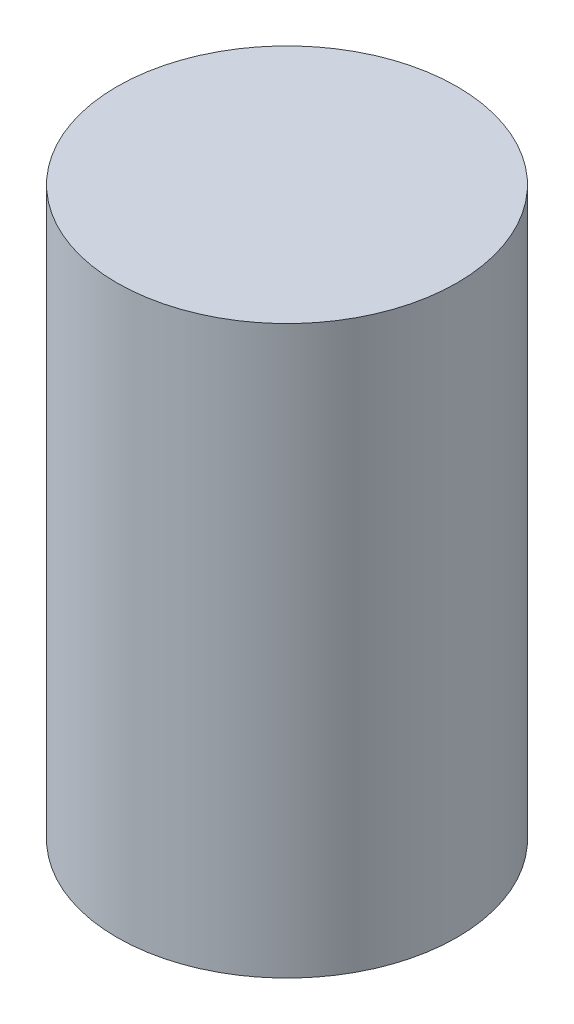
ISO-10303-21;
HEADER;
FILE_DESCRIPTION(('STEP AP214'),'2;1');
FILE_NAME('part.step','',(''),(''),'','','');
FILE_SCHEMA(('AUTOMOTIVE_DESIGN { 1 0 10303 214 1 1 1 1 }'));
ENDSEC;
DATA;
#1=APPLICATION_CONTEXT('core data for automotive mechanical design processes');
#2=APPLICATION_PROTOCOL_DEFINITION('international standard','automotive_design',2000,#1);
#3=PRODUCT_CONTEXT('',#1,'mechanical');
#4=PRODUCT('Part','Part','',(#3));
#5=PRODUCT_RELATED_PRODUCT_CATEGORY('part','',(#4));
#6=PRODUCT_DEFINITION_FORMATION('','',#4);
#7=PRODUCT_DEFINITION_CONTEXT('part definition',#1,'design');
#8=PRODUCT_DEFINITION('design','',#6,#7);
#9=PRODUCT_DEFINITION_SHAPE('','',#8);
#10=(LENGTH_UNIT() NAMED_UNIT(*) SI_UNIT(.MILLI.,.METRE.));
#11=(NAMED_UNIT(*) PLANE_ANGLE_UNIT() SI_UNIT($,.RADIAN.));
#12=(NAMED_UNIT(*) SI_UNIT($,.STERADIAN.) SOLID_ANGLE_UNIT());
#13=UNCERTAINTY_MEASURE_WITH_UNIT(LENGTH_MEASURE(1.E-05),#10,'distance_accuracy_value','');
#14=(GEOMETRIC_REPRESENTATION_CONTEXT(3) GLOBAL_UNCERTAINTY_ASSIGNED_CONTEXT((#13)) GLOBAL_UNIT_ASSIGNED_CONTEXT((#10,
#11,#12)) REPRESENTATION_CONTEXT('',''));
#15=CARTESIAN_POINT('',(0.,0.,0.));
#16=DIRECTION('',(0.,0.,1.));
#17=DIRECTION('',(1.,0.,0.));
#18=AXIS2_PLACEMENT_3D('',#15,#16,#17);
#19=CARTESIAN_POINT('',(0.,2.5,0.));
#20=DIRECTION('',(0.,-1.,0.));
#21=DIRECTION('',(0.,0.,-1.));
#22=AXIS2_PLACEMENT_3D('',#19,#20,#21);
#23=CYLINDRICAL_SURFACE('',#22,1.5);
#24=CARTESIAN_POINT('',(0.,2.5,0.));
#25=DIRECTION('',(0.,1.,0.));
#26=DIRECTION('',(0.,0.,1.));
#27=AXIS2_PLACEMENT_3D('',#24,#25,#26);
#28=CIRCLE('',#27,1.5);
#29=CARTESIAN_POINT('',(0.,2.5,1.5));
#30=VERTEX_POINT('',#29);
#31=EDGE_CURVE('E10',#30,#30,#28,.T.);
#32=ORIENTED_EDGE('',*,*,#31,.F.);
#33=EDGE_LOOP('',(#32));
#34=FACE_BOUND('',#33,.T.);
#35=CARTESIAN_POINT('',(0.,-2.5,0.));
#36=DIRECTION('',(0.,1.,0.));
#37=DIRECTION('',(0.,0.,1.));
#38=AXIS2_PLACEMENT_3D('',#35,#36,#37);
#39=CIRCLE('',#38,1.5);
#40=CARTESIAN_POINT('',(0.,-2.5,1.5));
#41=VERTEX_POINT('',#40);
#42=EDGE_CURVE('E37',#41,#41,#39,.T.);
#43=ORIENTED_EDGE('',*,*,#42,.T.);
#44=EDGE_LOOP('',(#43));
#45=FACE_BOUND('',#44,.T.);
#46=ADVANCED_FACE('F34',(#34,#45),#23,.T.);
#47=CARTESIAN_POINT('',(0.,2.5,0.));
#48=DIRECTION('',(0.,1.,0.));
#49=DIRECTION('',(0.,0.,1.));
#50=AXIS2_PLACEMENT_3D('',#47,#48,#49);
#51=PLANE('',#50);
#52=ORIENTED_EDGE('',*,*,#31,.T.);
#53=EDGE_LOOP('',(#52));
#54=FACE_BOUND('',#53,.T.);
#55=ADVANCED_FACE('F49',(#54),#51,.T.);
#56=CARTESIAN_POINT('',(0.,-2.5,0.));
#57=DIRECTION('',(0.,1.,0.));
#58=DIRECTION('',(0.,0.,1.));
#59=AXIS2_PLACEMENT_3D('',#56,#57,#58);
#60=PLANE('',#59);
#61=ORIENTED_EDGE('',*,*,#42,.F.);
#62=EDGE_LOOP('',(#61));
#63=FACE_BOUND('',#62,.T.);
#64=ADVANCED_FACE('F47',(#63),#60,.F.);
#65=CLOSED_SHELL('',(#46,#55,#64));
#66=MANIFOLD_SOLID_BREP('B2',#65);
#67=ADVANCED_BREP_SHAPE_REPRESENTATION('',(#18,#66),#14);
#68=SHAPE_DEFINITION_REPRESENTATION(#9,#67);
ENDSEC;
END-ISO-10303-21;
